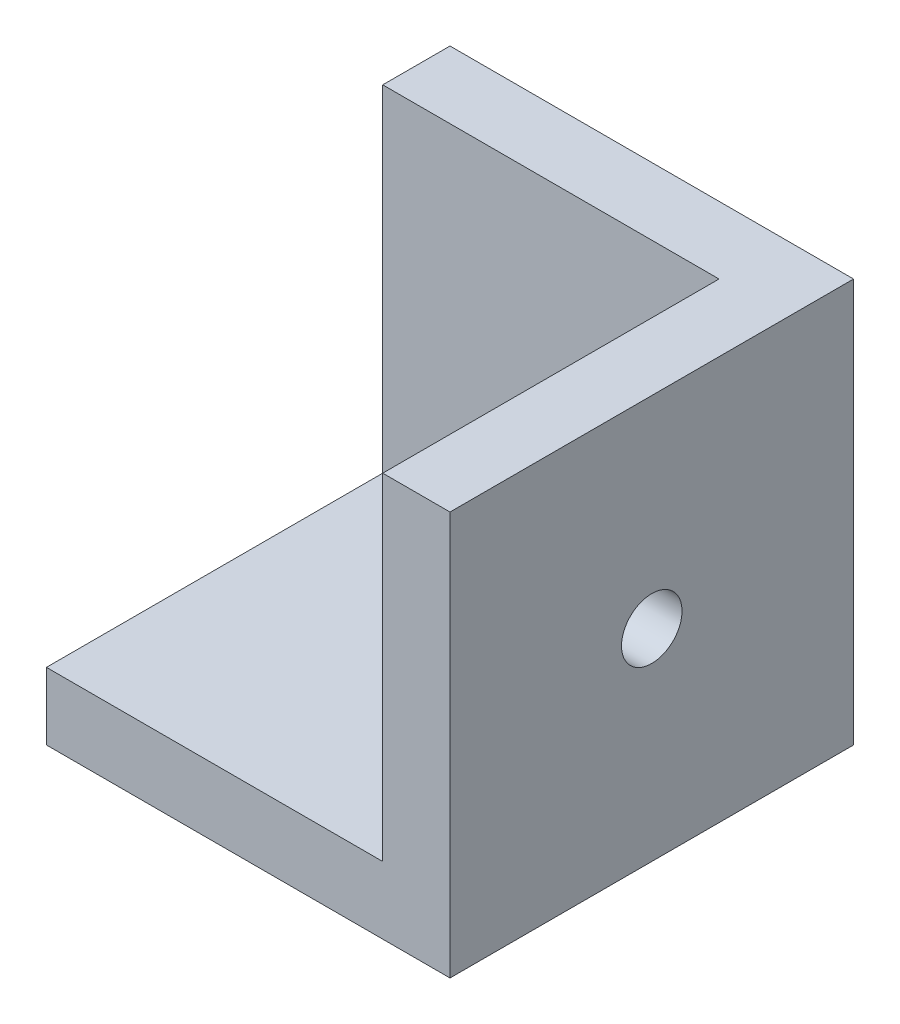
ISO-10303-21;
HEADER;
FILE_DESCRIPTION(('STEP AP214'),'2;1');
FILE_NAME('part.step','',(''),(''),'','','');
FILE_SCHEMA(('AUTOMOTIVE_DESIGN { 1 0 10303 214 1 1 1 1 }'));
ENDSEC;
DATA;
#1=APPLICATION_CONTEXT('core data for automotive mechanical design processes');
#2=APPLICATION_PROTOCOL_DEFINITION('international standard','automotive_design',2000,#1);
#3=PRODUCT_CONTEXT('',#1,'mechanical');
#4=PRODUCT('Part','Part','',(#3));
#5=PRODUCT_RELATED_PRODUCT_CATEGORY('part','',(#4));
#6=PRODUCT_DEFINITION_FORMATION('','',#4);
#7=PRODUCT_DEFINITION_CONTEXT('part definition',#1,'design');
#8=PRODUCT_DEFINITION('design','',#6,#7);
#9=PRODUCT_DEFINITION_SHAPE('','',#8);
#10=(LENGTH_UNIT() NAMED_UNIT(*) SI_UNIT(.MILLI.,.METRE.));
#11=(NAMED_UNIT(*) PLANE_ANGLE_UNIT() SI_UNIT($,.RADIAN.));
#12=(NAMED_UNIT(*) SI_UNIT($,.STERADIAN.) SOLID_ANGLE_UNIT());
#13=UNCERTAINTY_MEASURE_WITH_UNIT(LENGTH_MEASURE(1.E-05),#10,'distance_accuracy_value','');
#14=(GEOMETRIC_REPRESENTATION_CONTEXT(3) GLOBAL_UNCERTAINTY_ASSIGNED_CONTEXT((#13)) GLOBAL_UNIT_ASSIGNED_CONTEXT((#10,
#11,#12)) REPRESENTATION_CONTEXT('',''));
#15=CARTESIAN_POINT('',(0.,0.,0.));
#16=DIRECTION('',(0.,0.,1.));
#17=DIRECTION('',(1.,0.,0.));
#18=AXIS2_PLACEMENT_3D('',#15,#16,#17);
#19=CARTESIAN_POINT('',(0.,0.,30.));
#20=DIRECTION('',(-1.,0.,0.));
#21=DIRECTION('',(0.,0.,1.));
#22=AXIS2_PLACEMENT_3D('',#19,#20,#21);
#23=PLANE('',#22);
#24=CARTESIAN_POINT('',(0.,15.,15.));
#25=DIRECTION('',(-1.,0.,0.));
#26=DIRECTION('',(0.,0.,1.));
#27=AXIS2_PLACEMENT_3D('',#24,#25,#26);
#28=CIRCLE('',#27,2.25);
#29=CARTESIAN_POINT('',(0.,15.,17.25));
#30=VERTEX_POINT('',#29);
#31=EDGE_CURVE('E187',#30,#30,#28,.T.);
#32=ORIENTED_EDGE('',*,*,#31,.T.);
#33=EDGE_LOOP('',(#32));
#34=FACE_BOUND('',#33,.T.);
#35=DIRECTION('',(0.,1.,0.));
#36=VECTOR('',#35,1.);
#37=CARTESIAN_POINT('',(0.,0.,0.));
#38=LINE('',#37,#36);
#39=CARTESIAN_POINT('',(0.,0.,0.));
#40=VERTEX_POINT('',#39);
#41=CARTESIAN_POINT('',(0.,30.,0.));
#42=VERTEX_POINT('',#41);
#43=EDGE_CURVE('E135',#40,#42,#38,.T.);
#44=ORIENTED_EDGE('',*,*,#43,.T.);
#45=DIRECTION('',(0.,0.,-1.));
#46=VECTOR('',#45,1.);
#47=CARTESIAN_POINT('',(0.,30.,30.));
#48=LINE('',#47,#46);
#49=CARTESIAN_POINT('',(0.,30.,30.));
#50=VERTEX_POINT('',#49);
#51=EDGE_CURVE('E11',#50,#42,#48,.T.);
#52=ORIENTED_EDGE('',*,*,#51,.F.);
#53=DIRECTION('',(0.,1.,0.));
#54=VECTOR('',#53,1.);
#55=CARTESIAN_POINT('',(0.,0.,30.));
#56=LINE('',#55,#54);
#57=CARTESIAN_POINT('',(0.,0.,30.));
#58=VERTEX_POINT('',#57);
#59=EDGE_CURVE('E137',#58,#50,#56,.T.);
#60=ORIENTED_EDGE('',*,*,#59,.F.);
#61=DIRECTION('',(0.,0.,-1.));
#62=VECTOR('',#61,1.);
#63=CARTESIAN_POINT('',(0.,0.,30.));
#64=LINE('',#63,#62);
#65=EDGE_CURVE('E143',#58,#40,#64,.T.);
#66=ORIENTED_EDGE('',*,*,#65,.T.);
#67=EDGE_LOOP('',(#44,#52,#60,#66));
#68=FACE_BOUND('',#67,.T.);
#69=ADVANCED_FACE('F37',(#34,#68),#23,.F.);
#70=CARTESIAN_POINT('',(0.,30.,30.));
#71=DIRECTION('',(0.,-1.,0.));
#72=DIRECTION('',(1.,0.,0.));
#73=AXIS2_PLACEMENT_3D('',#70,#71,#72);
#74=PLANE('',#73);
#75=DIRECTION('',(-1.,0.,0.));
#76=VECTOR('',#75,1.);
#77=CARTESIAN_POINT('',(-5.,30.,5.));
#78=LINE('',#77,#76);
#79=CARTESIAN_POINT('',(-5.,30.,5.));
#80=VERTEX_POINT('',#79);
#81=CARTESIAN_POINT('',(-30.,30.,5.));
#82=VERTEX_POINT('',#81);
#83=EDGE_CURVE('E123',#80,#82,#78,.T.);
#84=ORIENTED_EDGE('',*,*,#83,.F.);
#85=DIRECTION('',(0.,0.,-1.));
#86=VECTOR('',#85,1.);
#87=CARTESIAN_POINT('',(-5.,30.,5.));
#88=LINE('',#87,#86);
#89=CARTESIAN_POINT('',(-5.,30.,30.));
#90=VERTEX_POINT('',#89);
#91=EDGE_CURVE('E111',#90,#80,#88,.T.);
#92=ORIENTED_EDGE('',*,*,#91,.F.);
#93=DIRECTION('',(-1.,0.,0.));
#94=VECTOR('',#93,1.);
#95=CARTESIAN_POINT('',(0.,30.,30.));
#96=LINE('',#95,#94);
#97=EDGE_CURVE('E86',#50,#90,#96,.T.);
#98=ORIENTED_EDGE('',*,*,#97,.F.);
#99=ORIENTED_EDGE('',*,*,#51,.T.);
#100=DIRECTION('',(-1.,0.,0.));
#101=VECTOR('',#100,1.);
#102=CARTESIAN_POINT('',(0.,30.,0.));
#103=LINE('',#102,#101);
#104=CARTESIAN_POINT('',(-30.,30.,0.));
#105=VERTEX_POINT('',#104);
#106=EDGE_CURVE('E146',#42,#105,#103,.T.);
#107=ORIENTED_EDGE('',*,*,#106,.T.);
#108=DIRECTION('',(0.,0.,-1.));
#109=VECTOR('',#108,1.);
#110=CARTESIAN_POINT('',(-30.,30.,30.));
#111=LINE('',#110,#109);
#112=EDGE_CURVE('E44',#82,#105,#111,.T.);
#113=ORIENTED_EDGE('',*,*,#112,.F.);
#114=EDGE_LOOP('',(#84,#92,#98,#99,#107,#113));
#115=FACE_BOUND('',#114,.T.);
#116=ADVANCED_FACE('F159',(#115),#74,.F.);
#117=CARTESIAN_POINT('',(-30.,0.,30.));
#118=DIRECTION('',(1.,0.,0.));
#119=DIRECTION('',(0.,0.,-1.));
#120=AXIS2_PLACEMENT_3D('',#117,#118,#119);
#121=PLANE('',#120);
#122=DIRECTION('',(0.,0.,1.));
#123=VECTOR('',#122,1.);
#124=CARTESIAN_POINT('',(-30.,5.,5.));
#125=LINE('',#124,#123);
#126=CARTESIAN_POINT('',(-30.,5.,5.));
#127=VERTEX_POINT('',#126);
#128=CARTESIAN_POINT('',(-30.,5.,30.));
#129=VERTEX_POINT('',#128);
#130=EDGE_CURVE('E51',#127,#129,#125,.T.);
#131=ORIENTED_EDGE('',*,*,#130,.F.);
#132=DIRECTION('',(0.,1.,0.));
#133=VECTOR('',#132,1.);
#134=CARTESIAN_POINT('',(-30.,5.,5.));
#135=LINE('',#134,#133);
#136=EDGE_CURVE('E114',#127,#82,#135,.T.);
#137=ORIENTED_EDGE('',*,*,#136,.T.);
#138=ORIENTED_EDGE('',*,*,#112,.T.);
#139=DIRECTION('',(0.,-1.,0.));
#140=VECTOR('',#139,1.);
#141=CARTESIAN_POINT('',(-30.,0.,0.));
#142=LINE('',#141,#140);
#143=CARTESIAN_POINT('',(-30.,0.,0.));
#144=VERTEX_POINT('',#143);
#145=EDGE_CURVE('E149',#105,#144,#142,.T.);
#146=ORIENTED_EDGE('',*,*,#145,.T.);
#147=DIRECTION('',(0.,0.,-1.));
#148=VECTOR('',#147,1.);
#149=CARTESIAN_POINT('',(-30.,0.,30.));
#150=LINE('',#149,#148);
#151=CARTESIAN_POINT('',(-30.,0.,30.));
#152=VERTEX_POINT('',#151);
#153=EDGE_CURVE('E153',#152,#144,#150,.T.);
#154=ORIENTED_EDGE('',*,*,#153,.F.);
#155=DIRECTION('',(0.,-1.,0.));
#156=VECTOR('',#155,1.);
#157=CARTESIAN_POINT('',(-30.,0.,30.));
#158=LINE('',#157,#156);
#159=EDGE_CURVE('E140',#129,#152,#158,.T.);
#160=ORIENTED_EDGE('',*,*,#159,.F.);
#161=EDGE_LOOP('',(#131,#137,#138,#146,#154,#160));
#162=FACE_BOUND('',#161,.T.);
#163=ADVANCED_FACE('F156',(#162),#121,.F.);
#164=CARTESIAN_POINT('',(0.,0.,30.));
#165=DIRECTION('',(0.,1.,0.));
#166=DIRECTION('',(-1.,0.,0.));
#167=AXIS2_PLACEMENT_3D('',#164,#165,#166);
#168=PLANE('',#167);
#169=CARTESIAN_POINT('',(-15.,0.,15.));
#170=DIRECTION('',(0.,1.,0.));
#171=DIRECTION('',(0.,0.,1.));
#172=AXIS2_PLACEMENT_3D('',#169,#170,#171);
#173=CIRCLE('',#172,2.25);
#174=CARTESIAN_POINT('',(-15.,0.,17.25));
#175=VERTEX_POINT('',#174);
#176=EDGE_CURVE('E127',#175,#175,#173,.T.);
#177=ORIENTED_EDGE('',*,*,#176,.T.);
#178=EDGE_LOOP('',(#177));
#179=FACE_BOUND('',#178,.T.);
#180=DIRECTION('',(1.,0.,0.));
#181=VECTOR('',#180,1.);
#182=CARTESIAN_POINT('',(0.,0.,0.));
#183=LINE('',#182,#181);
#184=EDGE_CURVE('E80',#144,#40,#183,.T.);
#185=ORIENTED_EDGE('',*,*,#184,.T.);
#186=ORIENTED_EDGE('',*,*,#65,.F.);
#187=DIRECTION('',(1.,0.,0.));
#188=VECTOR('',#187,1.);
#189=CARTESIAN_POINT('',(0.,0.,30.));
#190=LINE('',#189,#188);
#191=EDGE_CURVE('E60',#152,#58,#190,.T.);
#192=ORIENTED_EDGE('',*,*,#191,.F.);
#193=ORIENTED_EDGE('',*,*,#153,.T.);
#194=EDGE_LOOP('',(#185,#186,#192,#193));
#195=FACE_BOUND('',#194,.T.);
#196=ADVANCED_FACE('F166',(#179,#195),#168,.F.);
#197=CARTESIAN_POINT('',(0.,0.,30.));
#198=DIRECTION('',(0.,0.,1.));
#199=DIRECTION('',(1.,0.,0.));
#200=AXIS2_PLACEMENT_3D('',#197,#198,#199);
#201=PLANE('',#200);
#202=DIRECTION('',(0.,1.,0.));
#203=VECTOR('',#202,1.);
#204=CARTESIAN_POINT('',(-5.,5.,30.));
#205=LINE('',#204,#203);
#206=CARTESIAN_POINT('',(-5.,5.,30.));
#207=VERTEX_POINT('',#206);
#208=EDGE_CURVE('E133',#207,#90,#205,.T.);
#209=ORIENTED_EDGE('',*,*,#208,.F.);
#210=DIRECTION('',(1.,0.,0.));
#211=VECTOR('',#210,1.);
#212=CARTESIAN_POINT('',(-5.,5.,30.));
#213=LINE('',#212,#211);
#214=EDGE_CURVE('E115',#129,#207,#213,.T.);
#215=ORIENTED_EDGE('',*,*,#214,.F.);
#216=ORIENTED_EDGE('',*,*,#159,.T.);
#217=ORIENTED_EDGE('',*,*,#191,.T.);
#218=ORIENTED_EDGE('',*,*,#59,.T.);
#219=ORIENTED_EDGE('',*,*,#97,.T.);
#220=EDGE_LOOP('',(#209,#215,#216,#217,#218,#219));
#221=FACE_BOUND('',#220,.T.);
#222=ADVANCED_FACE('F168',(#221),#201,.T.);
#223=CARTESIAN_POINT('',(0.,0.,0.));
#224=DIRECTION('',(0.,0.,1.));
#225=DIRECTION('',(1.,0.,0.));
#226=AXIS2_PLACEMENT_3D('',#223,#224,#225);
#227=PLANE('',#226);
#228=CARTESIAN_POINT('',(-11.,15.,0.));
#229=DIRECTION('',(0.,0.,-1.));
#230=DIRECTION('',(-1.,0.,0.));
#231=AXIS2_PLACEMENT_3D('',#228,#229,#230);
#232=CIRCLE('',#231,1.7);
#233=CARTESIAN_POINT('',(-12.7,15.,0.));
#234=VERTEX_POINT('',#233);
#235=EDGE_CURVE('E199',#234,#234,#232,.T.);
#236=ORIENTED_EDGE('',*,*,#235,.F.);
#237=EDGE_LOOP('',(#236));
#238=FACE_BOUND('',#237,.T.);
#239=ORIENTED_EDGE('',*,*,#43,.F.);
#240=ORIENTED_EDGE('',*,*,#184,.F.);
#241=ORIENTED_EDGE('',*,*,#145,.F.);
#242=ORIENTED_EDGE('',*,*,#106,.F.);
#243=EDGE_LOOP('',(#239,#240,#241,#242));
#244=FACE_BOUND('',#243,.T.);
#245=ADVANCED_FACE('F163',(#238,#244),#227,.F.);
#246=CARTESIAN_POINT('',(-5.,5.,5.));
#247=DIRECTION('',(1.,0.,0.));
#248=DIRECTION('',(0.,0.,-1.));
#249=AXIS2_PLACEMENT_3D('',#246,#247,#248);
#250=PLANE('',#249);
#251=CARTESIAN_POINT('',(-5.,15.,15.));
#252=DIRECTION('',(-1.,0.,0.));
#253=DIRECTION('',(0.,0.,1.));
#254=AXIS2_PLACEMENT_3D('',#251,#252,#253);
#255=CIRCLE('',#254,2.25);
#256=CARTESIAN_POINT('',(-5.,15.,17.25));
#257=VERTEX_POINT('',#256);
#258=EDGE_CURVE('E190',#257,#257,#255,.T.);
#259=ORIENTED_EDGE('',*,*,#258,.F.);
#260=EDGE_LOOP('',(#259));
#261=FACE_BOUND('',#260,.T.);
#262=ORIENTED_EDGE('',*,*,#91,.T.);
#263=DIRECTION('',(0.,1.,0.));
#264=VECTOR('',#263,1.);
#265=CARTESIAN_POINT('',(-5.,5.,5.));
#266=LINE('',#265,#264);
#267=CARTESIAN_POINT('',(-5.,5.,5.));
#268=VERTEX_POINT('',#267);
#269=EDGE_CURVE('E106',#268,#80,#266,.T.);
#270=ORIENTED_EDGE('',*,*,#269,.F.);
#271=DIRECTION('',(0.,0.,-1.));
#272=VECTOR('',#271,1.);
#273=CARTESIAN_POINT('',(-5.,5.,5.));
#274=LINE('',#273,#272);
#275=EDGE_CURVE('E110',#207,#268,#274,.T.);
#276=ORIENTED_EDGE('',*,*,#275,.F.);
#277=ORIENTED_EDGE('',*,*,#208,.T.);
#278=EDGE_LOOP('',(#262,#270,#276,#277));
#279=FACE_BOUND('',#278,.T.);
#280=ADVANCED_FACE('F108',(#261,#279),#250,.F.);
#281=CARTESIAN_POINT('',(-5.,5.,5.));
#282=DIRECTION('',(0.,0.,-1.));
#283=DIRECTION('',(-1.,0.,0.));
#284=AXIS2_PLACEMENT_3D('',#281,#282,#283);
#285=PLANE('',#284);
#286=CARTESIAN_POINT('',(-11.,15.,5.));
#287=DIRECTION('',(0.,0.,-1.));
#288=DIRECTION('',(-1.,0.,0.));
#289=AXIS2_PLACEMENT_3D('',#286,#287,#288);
#290=CIRCLE('',#289,1.7);
#291=CARTESIAN_POINT('',(-12.7,15.,5.));
#292=VERTEX_POINT('',#291);
#293=EDGE_CURVE('E194',#292,#292,#290,.T.);
#294=ORIENTED_EDGE('',*,*,#293,.T.);
#295=EDGE_LOOP('',(#294));
#296=FACE_BOUND('',#295,.T.);
#297=ORIENTED_EDGE('',*,*,#83,.T.);
#298=ORIENTED_EDGE('',*,*,#136,.F.);
#299=DIRECTION('',(-1.,0.,0.));
#300=VECTOR('',#299,1.);
#301=CARTESIAN_POINT('',(-5.,5.,5.));
#302=LINE('',#301,#300);
#303=EDGE_CURVE('E117',#268,#127,#302,.T.);
#304=ORIENTED_EDGE('',*,*,#303,.F.);
#305=ORIENTED_EDGE('',*,*,#269,.T.);
#306=EDGE_LOOP('',(#297,#298,#304,#305));
#307=FACE_BOUND('',#306,.T.);
#308=ADVANCED_FACE('F118',(#296,#307),#285,.F.);
#309=CARTESIAN_POINT('',(0.,5.,0.));
#310=DIRECTION('',(0.,-1.,0.));
#311=DIRECTION('',(0.,0.,-1.));
#312=AXIS2_PLACEMENT_3D('',#309,#310,#311);
#313=PLANE('',#312);
#314=CARTESIAN_POINT('',(-15.,5.,15.));
#315=DIRECTION('',(0.,1.,0.));
#316=DIRECTION('',(0.,0.,1.));
#317=AXIS2_PLACEMENT_3D('',#314,#315,#316);
#318=CIRCLE('',#317,2.25);
#319=CARTESIAN_POINT('',(-15.,5.,17.25));
#320=VERTEX_POINT('',#319);
#321=EDGE_CURVE('E189',#320,#320,#318,.T.);
#322=ORIENTED_EDGE('',*,*,#321,.F.);
#323=EDGE_LOOP('',(#322));
#324=FACE_BOUND('',#323,.T.);
#325=ORIENTED_EDGE('',*,*,#275,.T.);
#326=ORIENTED_EDGE('',*,*,#303,.T.);
#327=ORIENTED_EDGE('',*,*,#130,.T.);
#328=ORIENTED_EDGE('',*,*,#214,.T.);
#329=EDGE_LOOP('',(#325,#326,#327,#328));
#330=FACE_BOUND('',#329,.T.);
#331=ADVANCED_FACE('F121',(#324,#330),#313,.F.);
#332=CARTESIAN_POINT('',(-15.,5.,15.));
#333=DIRECTION('',(0.,1.,0.));
#334=DIRECTION('',(0.,0.,1.));
#335=AXIS2_PLACEMENT_3D('',#332,#333,#334);
#336=CYLINDRICAL_SURFACE('',#335,2.25);
#337=ORIENTED_EDGE('',*,*,#176,.F.);
#338=EDGE_LOOP('',(#337));
#339=FACE_BOUND('',#338,.T.);
#340=ORIENTED_EDGE('',*,*,#321,.T.);
#341=EDGE_LOOP('',(#340));
#342=FACE_BOUND('',#341,.T.);
#343=ADVANCED_FACE('F216',(#339,#342),#336,.F.);
#344=CARTESIAN_POINT('',(-5.,15.,15.));
#345=DIRECTION('',(-1.,0.,0.));
#346=DIRECTION('',(0.,0.,1.));
#347=AXIS2_PLACEMENT_3D('',#344,#345,#346);
#348=CYLINDRICAL_SURFACE('',#347,2.25);
#349=ORIENTED_EDGE('',*,*,#31,.F.);
#350=EDGE_LOOP('',(#349));
#351=FACE_BOUND('',#350,.T.);
#352=ORIENTED_EDGE('',*,*,#258,.T.);
#353=EDGE_LOOP('',(#352));
#354=FACE_BOUND('',#353,.T.);
#355=ADVANCED_FACE('F206',(#351,#354),#348,.F.);
#356=CARTESIAN_POINT('',(-11.,15.,0.));
#357=DIRECTION('',(0.,0.,-1.));
#358=DIRECTION('',(-1.,0.,0.));
#359=AXIS2_PLACEMENT_3D('',#356,#357,#358);
#360=CYLINDRICAL_SURFACE('',#359,1.7);
#361=ORIENTED_EDGE('',*,*,#235,.T.);
#362=EDGE_LOOP('',(#361));
#363=FACE_BOUND('',#362,.T.);
#364=ORIENTED_EDGE('',*,*,#293,.F.);
#365=EDGE_LOOP('',(#364));
#366=FACE_BOUND('',#365,.T.);
#367=ADVANCED_FACE('F203',(#363,#366),#360,.F.);
#368=CLOSED_SHELL('',(#69,#116,#163,#196,#222,#245,#280,#308,#331,#343,#355,#367));
#369=MANIFOLD_SOLID_BREP('B2',#368);
#370=ADVANCED_BREP_SHAPE_REPRESENTATION('',(#18,#369),#14);
#371=SHAPE_DEFINITION_REPRESENTATION(#9,#370);
ENDSEC;
END-ISO-10303-21;
